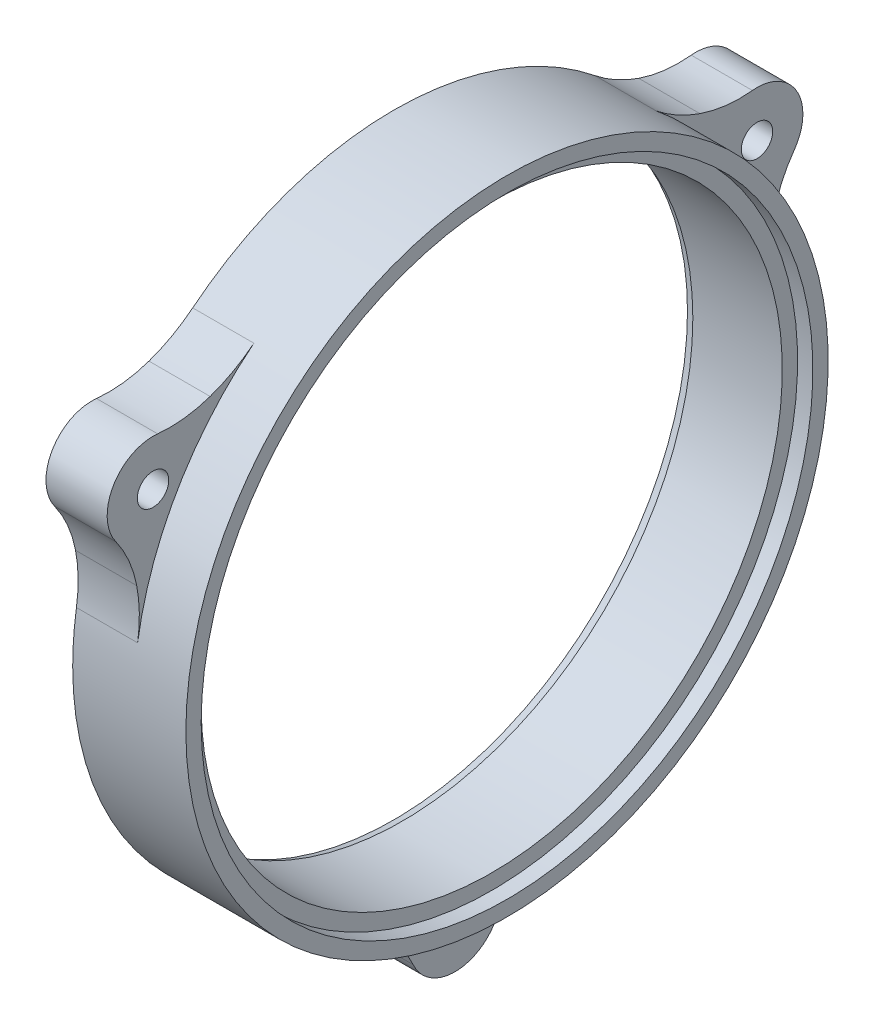
ISO-10303-21;
HEADER;
FILE_DESCRIPTION(('STEP AP214'),'2;1');
FILE_NAME('part.step','',(''),(''),'','','');
FILE_SCHEMA(('AUTOMOTIVE_DESIGN { 1 0 10303 214 1 1 1 1 }'));
ENDSEC;
DATA;
#1=APPLICATION_CONTEXT('core data for automotive mechanical design processes');
#2=APPLICATION_PROTOCOL_DEFINITION('international standard','automotive_design',2000,#1);
#3=PRODUCT_CONTEXT('',#1,'mechanical');
#4=PRODUCT('Part','Part','',(#3));
#5=PRODUCT_RELATED_PRODUCT_CATEGORY('part','',(#4));
#6=PRODUCT_DEFINITION_FORMATION('','',#4);
#7=PRODUCT_DEFINITION_CONTEXT('part definition',#1,'design');
#8=PRODUCT_DEFINITION('design','',#6,#7);
#9=PRODUCT_DEFINITION_SHAPE('','',#8);
#10=(LENGTH_UNIT() NAMED_UNIT(*) SI_UNIT(.MILLI.,.METRE.));
#11=(NAMED_UNIT(*) PLANE_ANGLE_UNIT() SI_UNIT($,.RADIAN.));
#12=(NAMED_UNIT(*) SI_UNIT($,.STERADIAN.) SOLID_ANGLE_UNIT());
#13=UNCERTAINTY_MEASURE_WITH_UNIT(LENGTH_MEASURE(1.E-05),#10,'distance_accuracy_value','');
#14=(GEOMETRIC_REPRESENTATION_CONTEXT(3) GLOBAL_UNCERTAINTY_ASSIGNED_CONTEXT((#13)) GLOBAL_UNIT_ASSIGNED_CONTEXT((#10,
#11,#12)) REPRESENTATION_CONTEXT('',''));
#15=CARTESIAN_POINT('',(0.,0.,0.));
#16=DIRECTION('',(0.,0.,1.));
#17=DIRECTION('',(1.,0.,0.));
#18=AXIS2_PLACEMENT_3D('',#15,#16,#17);
#19=CARTESIAN_POINT('',(0.,60.325,0.));
#20=DIRECTION('',(1.,0.,0.));
#21=DIRECTION('',(0.,0.,-1.));
#22=AXIS2_PLACEMENT_3D('',#19,#20,#21);
#23=PLANE('',#22);
#24=CARTESIAN_POINT('',(0.,0.,0.));
#25=DIRECTION('',(1.,0.,0.));
#26=DIRECTION('',(0.,0.,-1.));
#27=AXIS2_PLACEMENT_3D('',#24,#25,#26);
#28=CIRCLE('',#27,60.96);
#29=CARTESIAN_POINT('',(0.,0.,-60.96));
#30=VERTEX_POINT('',#29);
#31=EDGE_CURVE('E11',#30,#30,#28,.T.);
#32=ORIENTED_EDGE('',*,*,#31,.T.);
#33=EDGE_LOOP('',(#32));
#34=FACE_BOUND('',#33,.T.);
#35=CARTESIAN_POINT('',(0.,-72.39,5.27355936696949E-13));
#36=DIRECTION('',(-1.,0.,0.));
#37=DIRECTION('',(0.,0.,1.));
#38=AXIS2_PLACEMENT_3D('',#35,#36,#37);
#39=CIRCLE('',#38,3.2639);
#40=CARTESIAN_POINT('',(0.,-72.39,3.26390000000053));
#41=VERTEX_POINT('',#40);
#42=EDGE_CURVE('E331',#41,#41,#39,.T.);
#43=ORIENTED_EDGE('',*,*,#42,.F.);
#44=EDGE_LOOP('',(#43));
#45=FACE_BOUND('',#44,.T.);
#46=CARTESIAN_POINT('',(0.,36.1949999999998,-62.6915789799556));
#47=DIRECTION('',(-1.,0.,0.));
#48=DIRECTION('',(0.,0.,1.));
#49=AXIS2_PLACEMENT_3D('',#46,#47,#48);
#50=CIRCLE('',#49,3.2639);
#51=CARTESIAN_POINT('',(0.,36.1949999999998,-59.4276789799556));
#52=VERTEX_POINT('',#51);
#53=EDGE_CURVE('E250',#52,#52,#50,.T.);
#54=ORIENTED_EDGE('',*,*,#53,.F.);
#55=EDGE_LOOP('',(#54));
#56=FACE_BOUND('',#55,.T.);
#57=CARTESIAN_POINT('',(0.,0.,0.));
#58=DIRECTION('',(-1.,0.,0.));
#59=DIRECTION('',(0.,0.,1.));
#60=AXIS2_PLACEMENT_3D('',#57,#58,#59);
#61=CIRCLE('',#60,66.675);
#62=CARTESIAN_POINT('',(0.,10.1734653699422,-65.8942806878304));
#63=VERTEX_POINT('',#62);
#64=CARTESIAN_POINT('',(0.,-62.1528537247348,-24.1366608890236));
#65=VERTEX_POINT('',#64);
#66=EDGE_CURVE('E323',#63,#65,#61,.T.);
#67=ORIENTED_EDGE('',*,*,#66,.T.);
#68=CARTESIAN_POINT('',(0.,-90.5655868560422,-35.1705630097201));
#69=DIRECTION('',(1.,0.,0.));
#70=DIRECTION('',(0.,0.866025403784436,-0.500000000000004));
#71=AXIS2_PLACEMENT_3D('',#68,#69,#70);
#72=CIRCLE('',#71,30.4800000000001);
#73=CARTESIAN_POINT('',(0.,-67.5047313186697,-15.2399999999995));
#74=VERTEX_POINT('',#73);
#75=EDGE_CURVE('E240',#65,#74,#72,.T.);
#76=ORIENTED_EDGE('',*,*,#75,.T.);
#77=CARTESIAN_POINT('',(0.,-86.7221109331468,-31.8488025081));
#78=DIRECTION('',(1.,0.,0.));
#79=DIRECTION('',(0.,-0.866025403784436,0.500000000000004));
#80=AXIS2_PLACEMENT_3D('',#77,#78,#79);
#81=CIRCLE('',#80,25.4000000000001);
#82=CARTESIAN_POINT('',(0.,-76.2987575272218,-8.6860370476634));
#83=VERTEX_POINT('',#82);
#84=EDGE_CURVE('E243',#74,#83,#81,.T.);
#85=ORIENTED_EDGE('',*,*,#84,.T.);
#86=CARTESIAN_POINT('',(0.,-72.39,5.27355936696949E-13));
#87=DIRECTION('',(-1.,0.,0.));
#88=DIRECTION('',(0.,0.866025403784436,-0.500000000000004));
#89=AXIS2_PLACEMENT_3D('',#86,#87,#88);
#90=CIRCLE('',#89,9.52500000000013);
#91=CARTESIAN_POINT('',(0.,-76.2987575272218,8.68603704766442));
#92=VERTEX_POINT('',#91);
#93=EDGE_CURVE('E222',#83,#92,#90,.T.);
#94=ORIENTED_EDGE('',*,*,#93,.T.);
#95=CARTESIAN_POINT('',(0.,-86.7221109331463,31.848802508101));
#96=DIRECTION('',(1.,0.,0.));
#97=DIRECTION('',(0.,0.866025403784436,-0.500000000000004));
#98=AXIS2_PLACEMENT_3D('',#95,#96,#97);
#99=CIRCLE('',#98,25.4);
#100=CARTESIAN_POINT('',(0.,-67.5047313186694,15.2400000000005));
#101=VERTEX_POINT('',#100);
#102=EDGE_CURVE('E209',#92,#101,#99,.T.);
#103=ORIENTED_EDGE('',*,*,#102,.T.);
#104=CARTESIAN_POINT('',(0.,-90.5655868560417,35.1705630097211));
#105=DIRECTION('',(1.,0.,0.));
#106=DIRECTION('',(0.,-0.866025403784436,0.500000000000004));
#107=AXIS2_PLACEMENT_3D('',#104,#105,#106);
#108=CIRCLE('',#107,30.48);
#109=CARTESIAN_POINT('',(0.,-62.1528537247345,24.1366608890243));
#110=VERTEX_POINT('',#109);
#111=EDGE_CURVE('E56',#101,#110,#108,.T.);
#112=ORIENTED_EDGE('',*,*,#111,.T.);
#113=CARTESIAN_POINT('',(0.,10.173465369943,65.8942806878304));
#114=VERTEX_POINT('',#113);
#115=EDGE_CURVE('E326',#110,#114,#61,.T.);
#116=ORIENTED_EDGE('',*,*,#115,.T.);
#117=CARTESIAN_POINT('',(0.,14.8241923962027,96.0173804308386));
#118=DIRECTION('',(1.,0.,0.));
#119=DIRECTION('',(0.,-0.866025403784443,-0.499999999999992));
#120=AXIS2_PLACEMENT_3D('',#117,#118,#119);
#121=CIRCLE('',#120,30.4800000000001);
#122=CARTESIAN_POINT('',(0.,20.5541385056607,66.0808121976106));
#123=VERTEX_POINT('',#122);
#124=EDGE_CURVE('E203',#114,#123,#121,.T.);
#125=ORIENTED_EDGE('',*,*,#124,.T.);
#126=CARTESIAN_POINT('',(0.,15.7791834144456,91.0279523919672));
#127=DIRECTION('',(1.,0.,0.));
#128=DIRECTION('',(0.,0.866025403784443,0.499999999999992));
#129=AXIS2_PLACEMENT_3D('',#126,#127,#128);
#130=CIRCLE('',#129,25.4000000000001);
#131=CARTESIAN_POINT('',(0.,30.6270500221219,70.4196808195948));
#132=VERTEX_POINT('',#131);
#133=EDGE_CURVE('E186',#123,#132,#130,.T.);
#134=ORIENTED_EDGE('',*,*,#133,.T.);
#135=CARTESIAN_POINT('',(0.,36.1950000000007,62.6915789799551));
#136=DIRECTION('',(-1.,0.,0.));
#137=DIRECTION('',(0.,-0.866025403784443,-0.499999999999992));
#138=AXIS2_PLACEMENT_3D('',#135,#136,#137);
#139=CIRCLE('',#138,9.52500000000013);
#140=CARTESIAN_POINT('',(0.,45.6717075051013,61.7336437719308));
#141=VERTEX_POINT('',#140);
#142=EDGE_CURVE('E183',#132,#141,#139,.T.);
#143=ORIENTED_EDGE('',*,*,#142,.T.);
#144=CARTESIAN_POINT('',(0.,70.9429275187025,59.1791498838661));
#145=DIRECTION('',(1.,0.,0.));
#146=DIRECTION('',(0.,-0.866025403784443,-0.499999999999992));
#147=AXIS2_PLACEMENT_3D('',#144,#145,#146);
#148=CIRCLE('',#147,25.4);
#149=CARTESIAN_POINT('',(0.,46.9505928130102,50.8408121976102));
#150=VERTEX_POINT('',#149);
#151=EDGE_CURVE('E200',#141,#150,#148,.T.);
#152=ORIENTED_EDGE('',*,*,#151,.T.);
#153=CARTESIAN_POINT('',(0.,75.7413944598409,60.8468174211173));
#154=DIRECTION('',(1.,0.,0.));
#155=DIRECTION('',(0.,0.866025403784443,0.499999999999992));
#156=AXIS2_PLACEMENT_3D('',#153,#154,#155);
#157=CIRCLE('',#156,30.48);
#158=CARTESIAN_POINT('',(0.,51.9793883547928,41.757619798806));
#159=VERTEX_POINT('',#158);
#160=EDGE_CURVE('E49',#150,#159,#157,.T.);
#161=ORIENTED_EDGE('',*,*,#160,.T.);
#162=CARTESIAN_POINT('',(0.,51.9793883547923,-41.7576197988066));
#163=VERTEX_POINT('',#162);
#164=EDGE_CURVE('E322',#159,#163,#61,.T.);
#165=ORIENTED_EDGE('',*,*,#164,.T.);
#166=CARTESIAN_POINT('',(0.,75.7413944598402,-60.8468174211182));
#167=DIRECTION('',(1.,0.,0.));
#168=DIRECTION('',(0.,0.,1.));
#169=AXIS2_PLACEMENT_3D('',#166,#167,#168);
#170=CIRCLE('',#169,30.4800000000001);
#171=CARTESIAN_POINT('',(0.,46.9505928130095,-50.840812197611));
#172=VERTEX_POINT('',#171);
#173=EDGE_CURVE('E289',#163,#172,#170,.T.);
#174=ORIENTED_EDGE('',*,*,#173,.T.);
#175=CARTESIAN_POINT('',(0.,70.9429275187018,-59.179149883867));
#176=DIRECTION('',(1.,0.,0.));
#177=DIRECTION('',(0.,0.,-1.));
#178=AXIS2_PLACEMENT_3D('',#175,#176,#177);
#179=CIRCLE('',#178,25.4000000000001);
#180=CARTESIAN_POINT('',(0.,45.6717075051005,-61.7336437719313));
#181=VERTEX_POINT('',#180);
#182=EDGE_CURVE('E292',#172,#181,#179,.T.);
#183=ORIENTED_EDGE('',*,*,#182,.T.);
#184=CARTESIAN_POINT('',(0.,36.1949999999998,-62.6915789799556));
#185=DIRECTION('',(-1.,0.,0.));
#186=DIRECTION('',(0.,0.,1.));
#187=AXIS2_PLACEMENT_3D('',#184,#185,#186);
#188=CIRCLE('',#187,9.52500000000013);
#189=CARTESIAN_POINT('',(0.,30.627050022121,-70.4196808195953));
#190=VERTEX_POINT('',#189);
#191=EDGE_CURVE('E268',#181,#190,#188,.T.);
#192=ORIENTED_EDGE('',*,*,#191,.T.);
#193=CARTESIAN_POINT('',(0.,15.7791834144446,-91.0279523919674));
#194=DIRECTION('',(1.,0.,0.));
#195=DIRECTION('',(0.,0.,1.));
#196=AXIS2_PLACEMENT_3D('',#193,#194,#195);
#197=CIRCLE('',#196,25.4);
#198=CARTESIAN_POINT('',(0.,20.5541385056597,-66.0808121976108));
#199=VERTEX_POINT('',#198);
#200=EDGE_CURVE('E284',#190,#199,#197,.T.);
#201=ORIENTED_EDGE('',*,*,#200,.T.);
#202=CARTESIAN_POINT('',(0.,14.8241923962015,-96.0173804308387));
#203=DIRECTION('',(1.,0.,0.));
#204=DIRECTION('',(0.,0.,-1.));
#205=AXIS2_PLACEMENT_3D('',#202,#203,#204);
#206=CIRCLE('',#205,30.48);
#207=EDGE_CURVE('E287',#199,#63,#206,.T.);
#208=ORIENTED_EDGE('',*,*,#207,.T.);
#209=EDGE_LOOP('',(#67,#76,#85,#94,#103,#112,#116,#125,#134,#143,#152,#161,#165,#174,#183,#192,
#201,#208));
#210=FACE_BOUND('',#209,.T.);
#211=CARTESIAN_POINT('',(0.,36.1950000000007,62.6915789799551));
#212=DIRECTION('',(-1.,0.,0.));
#213=DIRECTION('',(0.,0.,1.));
#214=AXIS2_PLACEMENT_3D('',#211,#212,#213);
#215=CIRCLE('',#214,3.2639);
#216=CARTESIAN_POINT('',(0.,36.1950000000007,65.9554789799551));
#217=VERTEX_POINT('',#216);
#218=EDGE_CURVE('E332',#217,#217,#215,.T.);
#219=ORIENTED_EDGE('',*,*,#218,.F.);
#220=EDGE_LOOP('',(#219));
#221=FACE_BOUND('',#220,.T.);
#222=ADVANCED_FACE('F34',(#34,#45,#56,#210,#221),#23,.F.);
#223=CARTESIAN_POINT('',(0.,0.,0.));
#224=DIRECTION('',(-1.,0.,0.));
#225=DIRECTION('',(0.,0.,1.));
#226=AXIS2_PLACEMENT_3D('',#223,#224,#225);
#227=CYLINDRICAL_SURFACE('',#226,66.675);
#228=CARTESIAN_POINT('',(12.7,0.,0.));
#229=DIRECTION('',(1.,0.,0.));
#230=DIRECTION('',(0.,0.866025403784443,0.499999999999992));
#231=AXIS2_PLACEMENT_3D('',#228,#229,#230);
#232=CIRCLE('',#231,66.675);
#233=CARTESIAN_POINT('',(12.7,51.9793883547928,41.757619798806));
#234=VERTEX_POINT('',#233);
#235=CARTESIAN_POINT('',(12.7,10.173465369943,65.8942806878304));
#236=VERTEX_POINT('',#235);
#237=EDGE_CURVE('E179',#234,#236,#232,.T.);
#238=ORIENTED_EDGE('',*,*,#237,.T.);
#239=DIRECTION('',(-1.,0.,0.));
#240=VECTOR('',#239,1.);
#241=CARTESIAN_POINT('',(12.7,10.173465369943,65.8942806878304));
#242=LINE('',#241,#240);
#243=EDGE_CURVE('E214',#236,#114,#242,.T.);
#244=ORIENTED_EDGE('',*,*,#243,.T.);
#245=ORIENTED_EDGE('',*,*,#115,.F.);
#246=DIRECTION('',(-1.,0.,0.));
#247=VECTOR('',#246,1.);
#248=CARTESIAN_POINT('',(12.7,-62.1528537247345,24.1366608890243));
#249=LINE('',#248,#247);
#250=CARTESIAN_POINT('',(12.7,-62.1528537247345,24.1366608890243));
#251=VERTEX_POINT('',#250);
#252=EDGE_CURVE('E258',#251,#110,#249,.T.);
#253=ORIENTED_EDGE('',*,*,#252,.F.);
#254=CARTESIAN_POINT('',(12.7,0.,0.));
#255=DIRECTION('',(1.,0.,0.));
#256=DIRECTION('',(0.,-0.866025403784436,0.500000000000004));
#257=AXIS2_PLACEMENT_3D('',#254,#255,#256);
#258=CIRCLE('',#257,66.675);
#259=CARTESIAN_POINT('',(12.7,-62.1528537247348,-24.1366608890236));
#260=VERTEX_POINT('',#259);
#261=EDGE_CURVE('E225',#251,#260,#258,.T.);
#262=ORIENTED_EDGE('',*,*,#261,.T.);
#263=DIRECTION('',(-1.,0.,0.));
#264=VECTOR('',#263,1.);
#265=CARTESIAN_POINT('',(12.7,-62.1528537247348,-24.1366608890236));
#266=LINE('',#265,#264);
#267=EDGE_CURVE('E255',#260,#65,#266,.T.);
#268=ORIENTED_EDGE('',*,*,#267,.T.);
#269=ORIENTED_EDGE('',*,*,#66,.F.);
#270=DIRECTION('',(-1.,0.,0.));
#271=VECTOR('',#270,1.);
#272=CARTESIAN_POINT('',(12.7,10.1734653699422,-65.8942806878304));
#273=LINE('',#272,#271);
#274=CARTESIAN_POINT('',(12.7,10.1734653699422,-65.8942806878304));
#275=VERTEX_POINT('',#274);
#276=EDGE_CURVE('E307',#275,#63,#273,.T.);
#277=ORIENTED_EDGE('',*,*,#276,.F.);
#278=CARTESIAN_POINT('',(12.7,0.,0.));
#279=DIRECTION('',(1.,0.,0.));
#280=DIRECTION('',(0.,0.,-1.));
#281=AXIS2_PLACEMENT_3D('',#278,#279,#280);
#282=CIRCLE('',#281,66.675);
#283=CARTESIAN_POINT('',(12.7,51.9793883547923,-41.7576197988066));
#284=VERTEX_POINT('',#283);
#285=EDGE_CURVE('E271',#275,#284,#282,.T.);
#286=ORIENTED_EDGE('',*,*,#285,.T.);
#287=DIRECTION('',(-1.,0.,0.));
#288=VECTOR('',#287,1.);
#289=CARTESIAN_POINT('',(12.7,51.9793883547923,-41.7576197988066));
#290=LINE('',#289,#288);
#291=EDGE_CURVE('E304',#284,#163,#290,.T.);
#292=ORIENTED_EDGE('',*,*,#291,.T.);
#293=ORIENTED_EDGE('',*,*,#164,.F.);
#294=DIRECTION('',(-1.,0.,0.));
#295=VECTOR('',#294,1.);
#296=CARTESIAN_POINT('',(12.7,51.9793883547928,41.757619798806));
#297=LINE('',#296,#295);
#298=EDGE_CURVE('E168',#234,#159,#297,.T.);
#299=ORIENTED_EDGE('',*,*,#298,.F.);
#300=EDGE_LOOP('',(#238,#244,#245,#253,#262,#268,#269,#277,#286,#292,#293,#299));
#301=FACE_BOUND('',#300,.T.);
#302=CARTESIAN_POINT('',(23.495,0.,0.));
#303=DIRECTION('',(-1.,0.,0.));
#304=DIRECTION('',(0.,0.,1.));
#305=AXIS2_PLACEMENT_3D('',#302,#303,#304);
#306=CIRCLE('',#305,66.675);
#307=CARTESIAN_POINT('',(23.495,0.,66.675));
#308=VERTEX_POINT('',#307);
#309=EDGE_CURVE('E319',#308,#308,#306,.T.);
#310=ORIENTED_EDGE('',*,*,#309,.T.);
#311=EDGE_LOOP('',(#310));
#312=FACE_BOUND('',#311,.T.);
#313=ADVANCED_FACE('F350',(#301,#312),#227,.T.);
#314=CARTESIAN_POINT('',(23.495,66.675,0.));
#315=DIRECTION('',(-1.,0.,0.));
#316=DIRECTION('',(0.,0.,1.));
#317=AXIS2_PLACEMENT_3D('',#314,#315,#316);
#318=PLANE('',#317);
#319=ORIENTED_EDGE('',*,*,#309,.F.);
#320=EDGE_LOOP('',(#319));
#321=FACE_BOUND('',#320,.T.);
#322=CARTESIAN_POINT('',(23.495,0.,0.));
#323=DIRECTION('',(-1.,0.,0.));
#324=DIRECTION('',(0.,0.,1.));
#325=AXIS2_PLACEMENT_3D('',#322,#323,#324);
#326=CIRCLE('',#325,63.5);
#327=CARTESIAN_POINT('',(23.495,0.,63.5));
#328=VERTEX_POINT('',#327);
#329=EDGE_CURVE('E316',#328,#328,#326,.T.);
#330=ORIENTED_EDGE('',*,*,#329,.T.);
#331=EDGE_LOOP('',(#330));
#332=FACE_BOUND('',#331,.T.);
#333=ADVANCED_FACE('F355',(#321,#332),#318,.F.);
#334=CARTESIAN_POINT('',(0.,0.,0.));
#335=DIRECTION('',(-1.,0.,0.));
#336=DIRECTION('',(0.,0.,1.));
#337=AXIS2_PLACEMENT_3D('',#334,#335,#336);
#338=CYLINDRICAL_SURFACE('',#337,63.5);
#339=ORIENTED_EDGE('',*,*,#329,.F.);
#340=EDGE_LOOP('',(#339));
#341=FACE_BOUND('',#340,.T.);
#342=CARTESIAN_POINT('',(20.32,0.,0.));
#343=DIRECTION('',(-1.,0.,0.));
#344=DIRECTION('',(0.,0.,1.));
#345=AXIS2_PLACEMENT_3D('',#342,#343,#344);
#346=CIRCLE('',#345,63.5);
#347=CARTESIAN_POINT('',(20.32,0.,63.5));
#348=VERTEX_POINT('',#347);
#349=EDGE_CURVE('E313',#348,#348,#346,.T.);
#350=ORIENTED_EDGE('',*,*,#349,.T.);
#351=EDGE_LOOP('',(#350));
#352=FACE_BOUND('',#351,.T.);
#353=ADVANCED_FACE('F362',(#341,#352),#338,.F.);
#354=CARTESIAN_POINT('',(20.32,63.5,0.));
#355=DIRECTION('',(-1.,0.,0.));
#356=DIRECTION('',(0.,0.,1.));
#357=AXIS2_PLACEMENT_3D('',#354,#355,#356);
#358=PLANE('',#357);
#359=ORIENTED_EDGE('',*,*,#349,.F.);
#360=EDGE_LOOP('',(#359));
#361=FACE_BOUND('',#360,.T.);
#362=CARTESIAN_POINT('',(20.32,0.,0.));
#363=DIRECTION('',(-1.,0.,0.));
#364=DIRECTION('',(0.,0.,1.));
#365=AXIS2_PLACEMENT_3D('',#362,#363,#364);
#366=CIRCLE('',#365,60.325);
#367=CARTESIAN_POINT('',(20.32,0.,60.325));
#368=VERTEX_POINT('',#367);
#369=EDGE_CURVE('E299',#368,#368,#366,.T.);
#370=ORIENTED_EDGE('',*,*,#369,.T.);
#371=EDGE_LOOP('',(#370));
#372=FACE_BOUND('',#371,.T.);
#373=ADVANCED_FACE('F366',(#361,#372),#358,.F.);
#374=CARTESIAN_POINT('',(0.,0.,0.));
#375=DIRECTION('',(-1.,0.,0.));
#376=DIRECTION('',(0.,0.,1.));
#377=AXIS2_PLACEMENT_3D('',#374,#375,#376);
#378=CYLINDRICAL_SURFACE('',#377,60.325);
#379=CARTESIAN_POINT('',(1.74464816135364,0.,0.));
#380=DIRECTION('',(1.,0.,0.));
#381=DIRECTION('',(0.,0.,-1.));
#382=AXIS2_PLACEMENT_3D('',#379,#380,#381);
#383=CIRCLE('',#382,60.325);
#384=CARTESIAN_POINT('',(1.74464816135364,0.,-60.325));
#385=VERTEX_POINT('',#384);
#386=EDGE_CURVE('E42',#385,#385,#383,.F.);
#387=ORIENTED_EDGE('',*,*,#386,.T.);
#388=EDGE_LOOP('',(#387));
#389=FACE_BOUND('',#388,.T.);
#390=ORIENTED_EDGE('',*,*,#369,.F.);
#391=EDGE_LOOP('',(#390));
#392=FACE_BOUND('',#391,.T.);
#393=ADVANCED_FACE('F336',(#389,#392),#378,.F.);
#394=CARTESIAN_POINT('',(12.7,15.7791834144446,-91.0279523919674));
#395=DIRECTION('',(-1.,0.,0.));
#396=DIRECTION('',(0.,0.,1.));
#397=AXIS2_PLACEMENT_3D('',#394,#395,#396);
#398=CYLINDRICAL_SURFACE('',#397,25.4);
#399=ORIENTED_EDGE('',*,*,#200,.F.);
#400=DIRECTION('',(-1.,0.,0.));
#401=VECTOR('',#400,1.);
#402=CARTESIAN_POINT('',(12.7,30.627050022121,-70.4196808195953));
#403=LINE('',#402,#401);
#404=CARTESIAN_POINT('',(12.7,30.627050022121,-70.4196808195953));
#405=VERTEX_POINT('',#404);
#406=EDGE_CURVE('E297',#405,#190,#403,.T.);
#407=ORIENTED_EDGE('',*,*,#406,.F.);
#408=CARTESIAN_POINT('',(12.7,15.7791834144446,-91.0279523919674));
#409=DIRECTION('',(1.,0.,0.));
#410=DIRECTION('',(0.,0.,1.));
#411=AXIS2_PLACEMENT_3D('',#408,#409,#410);
#412=CIRCLE('',#411,25.4);
#413=CARTESIAN_POINT('',(12.7,20.5541385056597,-66.0808121976108));
#414=VERTEX_POINT('',#413);
#415=EDGE_CURVE('E264',#405,#414,#412,.T.);
#416=ORIENTED_EDGE('',*,*,#415,.T.);
#417=DIRECTION('',(-1.,0.,0.));
#418=VECTOR('',#417,1.);
#419=CARTESIAN_POINT('',(12.7,20.5541385056597,-66.0808121976108));
#420=LINE('',#419,#418);
#421=EDGE_CURVE('E283',#414,#199,#420,.T.);
#422=ORIENTED_EDGE('',*,*,#421,.T.);
#423=EDGE_LOOP('',(#399,#407,#416,#422));
#424=FACE_BOUND('',#423,.T.);
#425=ADVANCED_FACE('F373',(#424),#398,.F.);
#426=CARTESIAN_POINT('',(12.7,36.1949999999998,-62.6915789799556));
#427=DIRECTION('',(-1.,0.,0.));
#428=DIRECTION('',(0.,0.,1.));
#429=AXIS2_PLACEMENT_3D('',#426,#427,#428);
#430=CYLINDRICAL_SURFACE('',#429,9.52500000000013);
#431=ORIENTED_EDGE('',*,*,#191,.F.);
#432=DIRECTION('',(-1.,0.,0.));
#433=VECTOR('',#432,1.);
#434=CARTESIAN_POINT('',(12.7,45.6717075051005,-61.7336437719313));
#435=LINE('',#434,#433);
#436=CARTESIAN_POINT('',(12.7,45.6717075051005,-61.7336437719313));
#437=VERTEX_POINT('',#436);
#438=EDGE_CURVE('E300',#437,#181,#435,.T.);
#439=ORIENTED_EDGE('',*,*,#438,.F.);
#440=CARTESIAN_POINT('',(12.7,36.1949999999998,-62.6915789799556));
#441=DIRECTION('',(-1.,0.,0.));
#442=DIRECTION('',(0.,0.,1.));
#443=AXIS2_PLACEMENT_3D('',#440,#441,#442);
#444=CIRCLE('',#443,9.52500000000013);
#445=EDGE_CURVE('E280',#437,#405,#444,.T.);
#446=ORIENTED_EDGE('',*,*,#445,.T.);
#447=ORIENTED_EDGE('',*,*,#406,.T.);
#448=EDGE_LOOP('',(#431,#439,#446,#447));
#449=FACE_BOUND('',#448,.T.);
#450=ADVANCED_FACE('F376',(#449),#430,.T.);
#451=CARTESIAN_POINT('',(12.7,70.9429275187018,-59.179149883867));
#452=DIRECTION('',(-1.,0.,0.));
#453=DIRECTION('',(0.,0.,1.));
#454=AXIS2_PLACEMENT_3D('',#451,#452,#453);
#455=CYLINDRICAL_SURFACE('',#454,25.4000000000001);
#456=ORIENTED_EDGE('',*,*,#182,.F.);
#457=DIRECTION('',(-1.,0.,0.));
#458=VECTOR('',#457,1.);
#459=CARTESIAN_POINT('',(12.7,46.9505928130095,-50.840812197611));
#460=LINE('',#459,#458);
#461=CARTESIAN_POINT('',(12.7,46.9505928130095,-50.840812197611));
#462=VERTEX_POINT('',#461);
#463=EDGE_CURVE('E302',#462,#172,#460,.T.);
#464=ORIENTED_EDGE('',*,*,#463,.F.);
#465=CARTESIAN_POINT('',(12.7,70.9429275187018,-59.179149883867));
#466=DIRECTION('',(1.,0.,0.));
#467=DIRECTION('',(0.,0.,-1.));
#468=AXIS2_PLACEMENT_3D('',#465,#466,#467);
#469=CIRCLE('',#468,25.4000000000001);
#470=EDGE_CURVE('E277',#462,#437,#469,.T.);
#471=ORIENTED_EDGE('',*,*,#470,.T.);
#472=ORIENTED_EDGE('',*,*,#438,.T.);
#473=EDGE_LOOP('',(#456,#464,#471,#472));
#474=FACE_BOUND('',#473,.T.);
#475=ADVANCED_FACE('F386',(#474),#455,.F.);
#476=CARTESIAN_POINT('',(12.7,75.7413944598402,-60.8468174211182));
#477=DIRECTION('',(-1.,0.,0.));
#478=DIRECTION('',(0.,0.,1.));
#479=AXIS2_PLACEMENT_3D('',#476,#477,#478);
#480=CYLINDRICAL_SURFACE('',#479,30.4800000000001);
#481=ORIENTED_EDGE('',*,*,#173,.F.);
#482=ORIENTED_EDGE('',*,*,#291,.F.);
#483=CARTESIAN_POINT('',(12.7,75.7413944598402,-60.8468174211182));
#484=DIRECTION('',(1.,0.,0.));
#485=DIRECTION('',(0.,0.,1.));
#486=AXIS2_PLACEMENT_3D('',#483,#484,#485);
#487=CIRCLE('',#486,30.4800000000001);
#488=EDGE_CURVE('E274',#284,#462,#487,.T.);
#489=ORIENTED_EDGE('',*,*,#488,.T.);
#490=ORIENTED_EDGE('',*,*,#463,.T.);
#491=EDGE_LOOP('',(#481,#482,#489,#490));
#492=FACE_BOUND('',#491,.T.);
#493=ADVANCED_FACE('F382',(#492),#480,.F.);
#494=CARTESIAN_POINT('',(12.7,14.8241923962015,-96.0173804308387));
#495=DIRECTION('',(-1.,0.,0.));
#496=DIRECTION('',(0.,0.,1.));
#497=AXIS2_PLACEMENT_3D('',#494,#495,#496);
#498=CYLINDRICAL_SURFACE('',#497,30.48);
#499=ORIENTED_EDGE('',*,*,#207,.F.);
#500=ORIENTED_EDGE('',*,*,#421,.F.);
#501=CARTESIAN_POINT('',(12.7,14.8241923962015,-96.0173804308387));
#502=DIRECTION('',(1.,0.,0.));
#503=DIRECTION('',(0.,0.,-1.));
#504=AXIS2_PLACEMENT_3D('',#501,#502,#503);
#505=CIRCLE('',#504,30.48);
#506=EDGE_CURVE('E267',#414,#275,#505,.T.);
#507=ORIENTED_EDGE('',*,*,#506,.T.);
#508=ORIENTED_EDGE('',*,*,#276,.T.);
#509=EDGE_LOOP('',(#499,#500,#507,#508));
#510=FACE_BOUND('',#509,.T.);
#511=ADVANCED_FACE('F378',(#510),#498,.F.);
#512=CARTESIAN_POINT('',(12.7,25.9870917072222,-76.8597656859615));
#513=DIRECTION('',(-1.,0.,0.));
#514=DIRECTION('',(0.,0.,1.));
#515=AXIS2_PLACEMENT_3D('',#512,#513,#514);
#516=PLANE('',#515);
#517=CARTESIAN_POINT('',(12.7,36.1949999999998,-62.6915789799556));
#518=DIRECTION('',(-1.,0.,0.));
#519=DIRECTION('',(0.,0.,1.));
#520=AXIS2_PLACEMENT_3D('',#517,#518,#519);
#521=CIRCLE('',#520,3.2639);
#522=CARTESIAN_POINT('',(12.7,36.1949999999998,-59.4276789799556));
#523=VERTEX_POINT('',#522);
#524=EDGE_CURVE('E263',#523,#523,#521,.T.);
#525=ORIENTED_EDGE('',*,*,#524,.T.);
#526=EDGE_LOOP('',(#525));
#527=FACE_BOUND('',#526,.T.);
#528=ORIENTED_EDGE('',*,*,#415,.F.);
#529=ORIENTED_EDGE('',*,*,#445,.F.);
#530=ORIENTED_EDGE('',*,*,#470,.F.);
#531=ORIENTED_EDGE('',*,*,#488,.F.);
#532=ORIENTED_EDGE('',*,*,#285,.F.);
#533=ORIENTED_EDGE('',*,*,#506,.F.);
#534=EDGE_LOOP('',(#528,#529,#530,#531,#532,#533));
#535=FACE_BOUND('',#534,.T.);
#536=ADVANCED_FACE('F381',(#527,#535),#516,.F.);
#537=CARTESIAN_POINT('',(0.,36.1949999999998,-62.6915789799556));
#538=DIRECTION('',(-1.,0.,0.));
#539=DIRECTION('',(0.,0.,1.));
#540=AXIS2_PLACEMENT_3D('',#537,#538,#539);
#541=CYLINDRICAL_SURFACE('',#540,3.2639);
#542=ORIENTED_EDGE('',*,*,#53,.T.);
#543=EDGE_LOOP('',(#542));
#544=FACE_BOUND('',#543,.T.);
#545=ORIENTED_EDGE('',*,*,#524,.F.);
#546=EDGE_LOOP('',(#545));
#547=FACE_BOUND('',#546,.T.);
#548=ADVANCED_FACE('F396',(#544,#547),#541,.F.);
#549=CARTESIAN_POINT('',(12.7,-86.7221109331463,31.848802508101));
#550=DIRECTION('',(-1.,0.,0.));
#551=DIRECTION('',(0.,0.,1.));
#552=AXIS2_PLACEMENT_3D('',#549,#550,#551);
#553=CYLINDRICAL_SURFACE('',#552,25.4);
#554=ORIENTED_EDGE('',*,*,#102,.F.);
#555=DIRECTION('',(-1.,0.,0.));
#556=VECTOR('',#555,1.);
#557=CARTESIAN_POINT('',(12.7,-76.2987575272218,8.68603704766442));
#558=LINE('',#557,#556);
#559=CARTESIAN_POINT('',(12.7,-76.2987575272218,8.68603704766442));
#560=VERTEX_POINT('',#559);
#561=EDGE_CURVE('E248',#560,#92,#558,.T.);
#562=ORIENTED_EDGE('',*,*,#561,.F.);
#563=CARTESIAN_POINT('',(12.7,-86.7221109331463,31.848802508101));
#564=DIRECTION('',(1.,0.,0.));
#565=DIRECTION('',(0.,0.866025403784436,-0.500000000000004));
#566=AXIS2_PLACEMENT_3D('',#563,#564,#565);
#567=CIRCLE('',#566,25.4);
#568=CARTESIAN_POINT('',(12.7,-67.5047313186694,15.2400000000005));
#569=VERTEX_POINT('',#568);
#570=EDGE_CURVE('E218',#560,#569,#567,.T.);
#571=ORIENTED_EDGE('',*,*,#570,.T.);
#572=DIRECTION('',(-1.,0.,0.));
#573=VECTOR('',#572,1.);
#574=CARTESIAN_POINT('',(12.7,-67.5047313186694,15.2400000000005));
#575=LINE('',#574,#573);
#576=EDGE_CURVE('E237',#569,#101,#575,.T.);
#577=ORIENTED_EDGE('',*,*,#576,.T.);
#578=EDGE_LOOP('',(#554,#562,#571,#577));
#579=FACE_BOUND('',#578,.T.);
#580=ADVANCED_FACE('F400',(#579),#553,.F.);
#581=CARTESIAN_POINT('',(12.7,-72.39,5.27355936696949E-13));
#582=DIRECTION('',(-1.,0.,0.));
#583=DIRECTION('',(0.,0.,1.));
#584=AXIS2_PLACEMENT_3D('',#581,#582,#583);
#585=CYLINDRICAL_SURFACE('',#584,9.52500000000013);
#586=ORIENTED_EDGE('',*,*,#93,.F.);
#587=DIRECTION('',(-1.,0.,0.));
#588=VECTOR('',#587,1.);
#589=CARTESIAN_POINT('',(12.7,-76.2987575272218,-8.6860370476634));
#590=LINE('',#589,#588);
#591=CARTESIAN_POINT('',(12.7,-76.2987575272218,-8.6860370476634));
#592=VERTEX_POINT('',#591);
#593=EDGE_CURVE('E251',#592,#83,#590,.T.);
#594=ORIENTED_EDGE('',*,*,#593,.F.);
#595=CARTESIAN_POINT('',(12.7,-72.39,5.27355936696949E-13));
#596=DIRECTION('',(-1.,0.,0.));
#597=DIRECTION('',(0.,0.866025403784436,-0.500000000000004));
#598=AXIS2_PLACEMENT_3D('',#595,#596,#597);
#599=CIRCLE('',#598,9.52500000000013);
#600=EDGE_CURVE('E234',#592,#560,#599,.T.);
#601=ORIENTED_EDGE('',*,*,#600,.T.);
#602=ORIENTED_EDGE('',*,*,#561,.T.);
#603=EDGE_LOOP('',(#586,#594,#601,#602));
#604=FACE_BOUND('',#603,.T.);
#605=ADVANCED_FACE('F404',(#604),#585,.T.);
#606=CARTESIAN_POINT('',(12.7,-86.7221109331468,-31.8488025081));
#607=DIRECTION('',(-1.,0.,0.));
#608=DIRECTION('',(0.,0.,1.));
#609=AXIS2_PLACEMENT_3D('',#606,#607,#608);
#610=CYLINDRICAL_SURFACE('',#609,25.4000000000001);
#611=ORIENTED_EDGE('',*,*,#84,.F.);
#612=DIRECTION('',(-1.,0.,0.));
#613=VECTOR('',#612,1.);
#614=CARTESIAN_POINT('',(12.7,-67.5047313186697,-15.2399999999995));
#615=LINE('',#614,#613);
#616=CARTESIAN_POINT('',(12.7,-67.5047313186697,-15.2399999999995));
#617=VERTEX_POINT('',#616);
#618=EDGE_CURVE('E253',#617,#74,#615,.T.);
#619=ORIENTED_EDGE('',*,*,#618,.F.);
#620=CARTESIAN_POINT('',(12.7,-86.7221109331468,-31.8488025081));
#621=DIRECTION('',(1.,0.,0.));
#622=DIRECTION('',(0.,-0.866025403784436,0.500000000000004));
#623=AXIS2_PLACEMENT_3D('',#620,#621,#622);
#624=CIRCLE('',#623,25.4000000000001);
#625=EDGE_CURVE('E231',#617,#592,#624,.T.);
#626=ORIENTED_EDGE('',*,*,#625,.T.);
#627=ORIENTED_EDGE('',*,*,#593,.T.);
#628=EDGE_LOOP('',(#611,#619,#626,#627));
#629=FACE_BOUND('',#628,.T.);
#630=ADVANCED_FACE('F414',(#629),#610,.F.);
#631=CARTESIAN_POINT('',(12.7,-90.5655868560422,-35.1705630097201));
#632=DIRECTION('',(-1.,0.,0.));
#633=DIRECTION('',(0.,0.,1.));
#634=AXIS2_PLACEMENT_3D('',#631,#632,#633);
#635=CYLINDRICAL_SURFACE('',#634,30.4800000000001);
#636=ORIENTED_EDGE('',*,*,#75,.F.);
#637=ORIENTED_EDGE('',*,*,#267,.F.);
#638=CARTESIAN_POINT('',(12.7,-90.5655868560422,-35.1705630097201));
#639=DIRECTION('',(1.,0.,0.));
#640=DIRECTION('',(0.,0.866025403784436,-0.500000000000004));
#641=AXIS2_PLACEMENT_3D('',#638,#639,#640);
#642=CIRCLE('',#641,30.4800000000001);
#643=EDGE_CURVE('E228',#260,#617,#642,.T.);
#644=ORIENTED_EDGE('',*,*,#643,.T.);
#645=ORIENTED_EDGE('',*,*,#618,.T.);
#646=EDGE_LOOP('',(#636,#637,#644,#645));
#647=FACE_BOUND('',#646,.T.);
#648=ADVANCED_FACE('F410',(#647),#635,.F.);
#649=CARTESIAN_POINT('',(12.7,-90.5655868560417,35.1705630097211));
#650=DIRECTION('',(-1.,0.,0.));
#651=DIRECTION('',(0.,0.,1.));
#652=AXIS2_PLACEMENT_3D('',#649,#650,#651);
#653=CYLINDRICAL_SURFACE('',#652,30.48);
#654=ORIENTED_EDGE('',*,*,#111,.F.);
#655=ORIENTED_EDGE('',*,*,#576,.F.);
#656=CARTESIAN_POINT('',(12.7,-90.5655868560417,35.1705630097211));
#657=DIRECTION('',(1.,0.,0.));
#658=DIRECTION('',(0.,-0.866025403784436,0.500000000000004));
#659=AXIS2_PLACEMENT_3D('',#656,#657,#658);
#660=CIRCLE('',#659,30.48);
#661=EDGE_CURVE('E221',#569,#251,#660,.T.);
#662=ORIENTED_EDGE('',*,*,#661,.T.);
#663=ORIENTED_EDGE('',*,*,#252,.T.);
#664=EDGE_LOOP('',(#654,#655,#662,#663));
#665=FACE_BOUND('',#664,.T.);
#666=ADVANCED_FACE('F406',(#665),#653,.F.);
#667=CARTESIAN_POINT('',(12.7,-79.5560554665732,15.9244012540508));
#668=DIRECTION('',(-1.,0.,0.));
#669=DIRECTION('',(0.,0.866025403784436,-0.500000000000004));
#670=AXIS2_PLACEMENT_3D('',#667,#668,#669);
#671=PLANE('',#670);
#672=CARTESIAN_POINT('',(12.7,-72.39,5.27355936696949E-13));
#673=DIRECTION('',(-1.,0.,0.));
#674=DIRECTION('',(0.,0.,1.));
#675=AXIS2_PLACEMENT_3D('',#672,#673,#674);
#676=CIRCLE('',#675,3.2639);
#677=CARTESIAN_POINT('',(12.7,-72.39,3.26390000000053));
#678=VERTEX_POINT('',#677);
#679=EDGE_CURVE('E189',#678,#678,#676,.T.);
#680=ORIENTED_EDGE('',*,*,#679,.T.);
#681=EDGE_LOOP('',(#680));
#682=FACE_BOUND('',#681,.T.);
#683=ORIENTED_EDGE('',*,*,#570,.F.);
#684=ORIENTED_EDGE('',*,*,#600,.F.);
#685=ORIENTED_EDGE('',*,*,#625,.F.);
#686=ORIENTED_EDGE('',*,*,#643,.F.);
#687=ORIENTED_EDGE('',*,*,#261,.F.);
#688=ORIENTED_EDGE('',*,*,#661,.F.);
#689=EDGE_LOOP('',(#683,#684,#685,#686,#687,#688));
#690=FACE_BOUND('',#689,.T.);
#691=ADVANCED_FACE('F409',(#682,#690),#671,.F.);
#692=CARTESIAN_POINT('',(12.7,70.9429275187025,59.1791498838661));
#693=DIRECTION('',(-1.,0.,0.));
#694=DIRECTION('',(0.,0.,1.));
#695=AXIS2_PLACEMENT_3D('',#692,#693,#694);
#696=CYLINDRICAL_SURFACE('',#695,25.4);
#697=ORIENTED_EDGE('',*,*,#151,.F.);
#698=DIRECTION('',(-1.,0.,0.));
#699=VECTOR('',#698,1.);
#700=CARTESIAN_POINT('',(12.7,45.6717075051013,61.7336437719308));
#701=LINE('',#700,#699);
#702=CARTESIAN_POINT('',(12.7,45.6717075051013,61.7336437719308));
#703=VERTEX_POINT('',#702);
#704=EDGE_CURVE('E182',#703,#141,#701,.T.);
#705=ORIENTED_EDGE('',*,*,#704,.F.);
#706=CARTESIAN_POINT('',(12.7,70.9429275187025,59.1791498838661));
#707=DIRECTION('',(1.,0.,0.));
#708=DIRECTION('',(0.,-0.866025403784443,-0.499999999999992));
#709=AXIS2_PLACEMENT_3D('',#706,#707,#708);
#710=CIRCLE('',#709,25.4);
#711=CARTESIAN_POINT('',(12.7,46.9505928130102,50.8408121976102));
#712=VERTEX_POINT('',#711);
#713=EDGE_CURVE('E175',#703,#712,#710,.T.);
#714=ORIENTED_EDGE('',*,*,#713,.T.);
#715=DIRECTION('',(-1.,0.,0.));
#716=VECTOR('',#715,1.);
#717=CARTESIAN_POINT('',(12.7,46.9505928130102,50.8408121976102));
#718=LINE('',#717,#716);
#719=EDGE_CURVE('E160',#712,#150,#718,.T.);
#720=ORIENTED_EDGE('',*,*,#719,.T.);
#721=EDGE_LOOP('',(#697,#705,#714,#720));
#722=FACE_BOUND('',#721,.T.);
#723=ADVANCED_FACE('F181',(#722),#696,.F.);
#724=CARTESIAN_POINT('',(12.7,36.1950000000007,62.6915789799551));
#725=DIRECTION('',(-1.,0.,0.));
#726=DIRECTION('',(0.,0.,1.));
#727=AXIS2_PLACEMENT_3D('',#724,#725,#726);
#728=CYLINDRICAL_SURFACE('',#727,9.52500000000013);
#729=ORIENTED_EDGE('',*,*,#142,.F.);
#730=DIRECTION('',(-1.,0.,0.));
#731=VECTOR('',#730,1.);
#732=CARTESIAN_POINT('',(12.7,30.6270500221219,70.4196808195948));
#733=LINE('',#732,#731);
#734=CARTESIAN_POINT('',(12.7,30.6270500221219,70.4196808195948));
#735=VERTEX_POINT('',#734);
#736=EDGE_CURVE('E210',#735,#132,#733,.T.);
#737=ORIENTED_EDGE('',*,*,#736,.F.);
#738=CARTESIAN_POINT('',(12.7,36.1950000000007,62.6915789799551));
#739=DIRECTION('',(-1.,0.,0.));
#740=DIRECTION('',(0.,-0.866025403784443,-0.499999999999992));
#741=AXIS2_PLACEMENT_3D('',#738,#739,#740);
#742=CIRCLE('',#741,9.52500000000013);
#743=EDGE_CURVE('E169',#735,#703,#742,.T.);
#744=ORIENTED_EDGE('',*,*,#743,.T.);
#745=ORIENTED_EDGE('',*,*,#704,.T.);
#746=EDGE_LOOP('',(#729,#737,#744,#745));
#747=FACE_BOUND('',#746,.T.);
#748=ADVANCED_FACE('F427',(#747),#728,.T.);
#749=CARTESIAN_POINT('',(12.7,15.7791834144456,91.0279523919672));
#750=DIRECTION('',(-1.,0.,0.));
#751=DIRECTION('',(0.,0.,1.));
#752=AXIS2_PLACEMENT_3D('',#749,#750,#751);
#753=CYLINDRICAL_SURFACE('',#752,25.4000000000001);
#754=ORIENTED_EDGE('',*,*,#133,.F.);
#755=DIRECTION('',(-1.,0.,0.));
#756=VECTOR('',#755,1.);
#757=CARTESIAN_POINT('',(12.7,20.5541385056607,66.0808121976106));
#758=LINE('',#757,#756);
#759=CARTESIAN_POINT('',(12.7,20.5541385056607,66.0808121976106));
#760=VERTEX_POINT('',#759);
#761=EDGE_CURVE('E212',#760,#123,#758,.T.);
#762=ORIENTED_EDGE('',*,*,#761,.F.);
#763=CARTESIAN_POINT('',(12.7,15.7791834144456,91.0279523919672));
#764=DIRECTION('',(1.,0.,0.));
#765=DIRECTION('',(0.,0.866025403784443,0.499999999999992));
#766=AXIS2_PLACEMENT_3D('',#763,#764,#765);
#767=CIRCLE('',#766,25.4000000000001);
#768=EDGE_CURVE('E196',#760,#735,#767,.T.);
#769=ORIENTED_EDGE('',*,*,#768,.T.);
#770=ORIENTED_EDGE('',*,*,#736,.T.);
#771=EDGE_LOOP('',(#754,#762,#769,#770));
#772=FACE_BOUND('',#771,.T.);
#773=ADVANCED_FACE('F433',(#772),#753,.F.);
#774=CARTESIAN_POINT('',(12.7,14.8241923962027,96.0173804308386));
#775=DIRECTION('',(-1.,0.,0.));
#776=DIRECTION('',(0.,0.,1.));
#777=AXIS2_PLACEMENT_3D('',#774,#775,#776);
#778=CYLINDRICAL_SURFACE('',#777,30.4800000000001);
#779=ORIENTED_EDGE('',*,*,#124,.F.);
#780=ORIENTED_EDGE('',*,*,#243,.F.);
#781=CARTESIAN_POINT('',(12.7,14.8241923962027,96.0173804308386));
#782=DIRECTION('',(1.,0.,0.));
#783=DIRECTION('',(0.,-0.866025403784443,-0.499999999999992));
#784=AXIS2_PLACEMENT_3D('',#781,#782,#783);
#785=CIRCLE('',#784,30.4800000000001);
#786=EDGE_CURVE('E193',#236,#760,#785,.T.);
#787=ORIENTED_EDGE('',*,*,#786,.T.);
#788=ORIENTED_EDGE('',*,*,#761,.T.);
#789=EDGE_LOOP('',(#779,#780,#787,#788));
#790=FACE_BOUND('',#789,.T.);
#791=ADVANCED_FACE('F430',(#790),#778,.F.);
#792=CARTESIAN_POINT('',(12.7,75.7413944598409,60.8468174211173));
#793=DIRECTION('',(-1.,0.,0.));
#794=DIRECTION('',(0.,0.,1.));
#795=AXIS2_PLACEMENT_3D('',#792,#793,#794);
#796=CYLINDRICAL_SURFACE('',#795,30.48);
#797=ORIENTED_EDGE('',*,*,#160,.F.);
#798=ORIENTED_EDGE('',*,*,#719,.F.);
#799=CARTESIAN_POINT('',(12.7,75.7413944598409,60.8468174211173));
#800=DIRECTION('',(1.,0.,0.));
#801=DIRECTION('',(0.,0.866025403784443,0.499999999999992));
#802=AXIS2_PLACEMENT_3D('',#799,#800,#801);
#803=CIRCLE('',#802,30.48);
#804=EDGE_CURVE('E163',#712,#234,#803,.T.);
#805=ORIENTED_EDGE('',*,*,#804,.T.);
#806=ORIENTED_EDGE('',*,*,#298,.T.);
#807=EDGE_LOOP('',(#797,#798,#805,#806));
#808=FACE_BOUND('',#807,.T.);
#809=ADVANCED_FACE('F162',(#808),#796,.F.);
#810=CARTESIAN_POINT('',(12.7,53.5689637593516,60.9353644319106));
#811=DIRECTION('',(-1.,0.,0.));
#812=DIRECTION('',(0.,-0.866025403784443,-0.499999999999992));
#813=AXIS2_PLACEMENT_3D('',#810,#811,#812);
#814=PLANE('',#813);
#815=CARTESIAN_POINT('',(12.7,36.1950000000007,62.6915789799551));
#816=DIRECTION('',(-1.,0.,0.));
#817=DIRECTION('',(0.,0.,1.));
#818=AXIS2_PLACEMENT_3D('',#815,#816,#817);
#819=CIRCLE('',#818,3.2639);
#820=CARTESIAN_POINT('',(12.7,36.1950000000007,65.9554789799551));
#821=VERTEX_POINT('',#820);
#822=EDGE_CURVE('E329',#821,#821,#819,.T.);
#823=ORIENTED_EDGE('',*,*,#822,.T.);
#824=EDGE_LOOP('',(#823));
#825=FACE_BOUND('',#824,.T.);
#826=ORIENTED_EDGE('',*,*,#713,.F.);
#827=ORIENTED_EDGE('',*,*,#743,.F.);
#828=ORIENTED_EDGE('',*,*,#768,.F.);
#829=ORIENTED_EDGE('',*,*,#786,.F.);
#830=ORIENTED_EDGE('',*,*,#237,.F.);
#831=ORIENTED_EDGE('',*,*,#804,.F.);
#832=EDGE_LOOP('',(#826,#827,#828,#829,#830,#831));
#833=FACE_BOUND('',#832,.T.);
#834=ADVANCED_FACE('F173',(#825,#833),#814,.F.);
#835=CARTESIAN_POINT('',(0.,-72.39,5.27355936696949E-13));
#836=DIRECTION('',(-1.,0.,0.));
#837=DIRECTION('',(0.,0.,1.));
#838=AXIS2_PLACEMENT_3D('',#835,#836,#837);
#839=CYLINDRICAL_SURFACE('',#838,3.2639);
#840=ORIENTED_EDGE('',*,*,#42,.T.);
#841=EDGE_LOOP('',(#840));
#842=FACE_BOUND('',#841,.T.);
#843=ORIENTED_EDGE('',*,*,#679,.F.);
#844=EDGE_LOOP('',(#843));
#845=FACE_BOUND('',#844,.T.);
#846=ADVANCED_FACE('F345',(#842,#845),#839,.F.);
#847=CARTESIAN_POINT('',(0.,36.1950000000007,62.6915789799551));
#848=DIRECTION('',(-1.,0.,0.));
#849=DIRECTION('',(0.,0.,1.));
#850=AXIS2_PLACEMENT_3D('',#847,#848,#849);
#851=CYLINDRICAL_SURFACE('',#850,3.2639);
#852=ORIENTED_EDGE('',*,*,#218,.T.);
#853=EDGE_LOOP('',(#852));
#854=FACE_BOUND('',#853,.T.);
#855=ORIENTED_EDGE('',*,*,#822,.F.);
#856=EDGE_LOOP('',(#855));
#857=FACE_BOUND('',#856,.T.);
#858=ADVANCED_FACE('F340',(#854,#857),#851,.F.);
#859=CARTESIAN_POINT('',(1.74464816135364,0.,0.));
#860=DIRECTION('',(-1.,0.,0.));
#861=DIRECTION('',(0.,0.,1.));
#862=AXIS2_PLACEMENT_3D('',#859,#860,#861);
#863=CONICAL_SURFACE('',#862,60.325,0.349065850398865);
#864=ORIENTED_EDGE('',*,*,#31,.F.);
#865=EDGE_LOOP('',(#864));
#866=FACE_BOUND('',#865,.T.);
#867=ORIENTED_EDGE('',*,*,#386,.F.);
#868=EDGE_LOOP('',(#867));
#869=FACE_BOUND('',#868,.T.);
#870=ADVANCED_FACE('F36',(#866,#869),#863,.F.);
#871=CLOSED_SHELL('',(#222,#313,#333,#353,#373,#393,#425,#450,#475,#493,#511,#536,#548,#580,
#605,#630,#648,#666,#691,#723,#748,#773,#791,#809,#834,#846,#858,#870));
#872=MANIFOLD_SOLID_BREP('B2',#871);
#873=ADVANCED_BREP_SHAPE_REPRESENTATION('',(#18,#872),#14);
#874=SHAPE_DEFINITION_REPRESENTATION(#9,#873);
ENDSEC;
END-ISO-10303-21;
